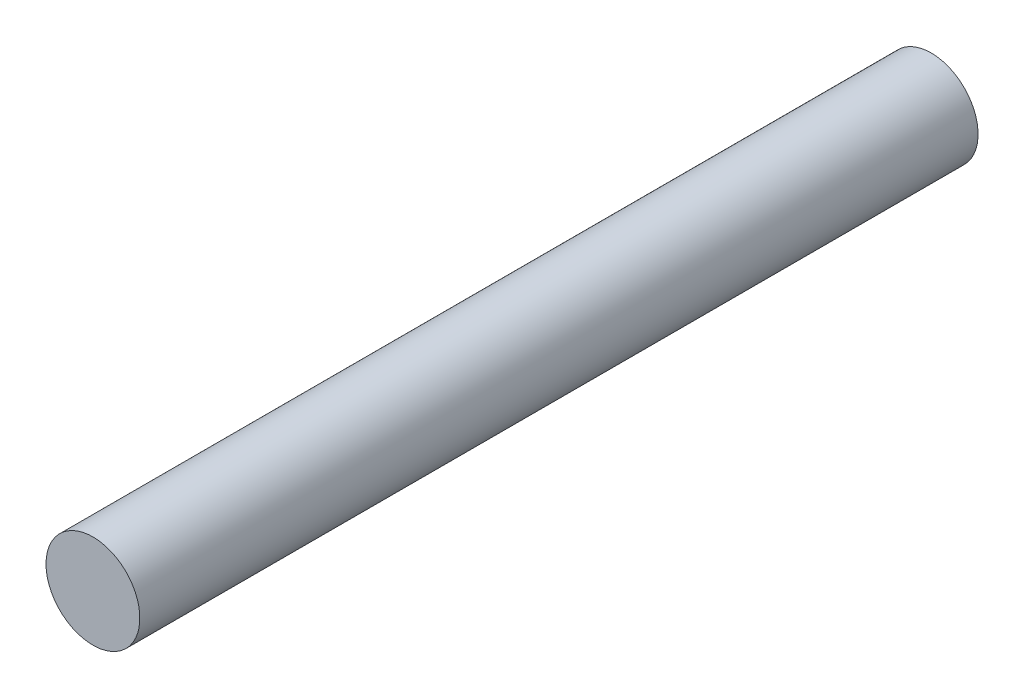
ISO-10303-21;
HEADER;
FILE_DESCRIPTION(('STEP AP214'),'2;1');
FILE_NAME('part.step','',(''),(''),'','','');
FILE_SCHEMA(('AUTOMOTIVE_DESIGN { 1 0 10303 214 1 1 1 1 }'));
ENDSEC;
DATA;
#1=APPLICATION_CONTEXT('core data for automotive mechanical design processes');
#2=APPLICATION_PROTOCOL_DEFINITION('international standard','automotive_design',2000,#1);
#3=PRODUCT_CONTEXT('',#1,'mechanical');
#4=PRODUCT('Part','Part','',(#3));
#5=PRODUCT_RELATED_PRODUCT_CATEGORY('part','',(#4));
#6=PRODUCT_DEFINITION_FORMATION('','',#4);
#7=PRODUCT_DEFINITION_CONTEXT('part definition',#1,'design');
#8=PRODUCT_DEFINITION('design','',#6,#7);
#9=PRODUCT_DEFINITION_SHAPE('','',#8);
#10=(LENGTH_UNIT() NAMED_UNIT(*) SI_UNIT(.MILLI.,.METRE.));
#11=(NAMED_UNIT(*) PLANE_ANGLE_UNIT() SI_UNIT($,.RADIAN.));
#12=(NAMED_UNIT(*) SI_UNIT($,.STERADIAN.) SOLID_ANGLE_UNIT());
#13=UNCERTAINTY_MEASURE_WITH_UNIT(LENGTH_MEASURE(1.E-05),#10,'distance_accuracy_value','');
#14=(GEOMETRIC_REPRESENTATION_CONTEXT(3) GLOBAL_UNCERTAINTY_ASSIGNED_CONTEXT((#13)) GLOBAL_UNIT_ASSIGNED_CONTEXT((#10,
#11,#12)) REPRESENTATION_CONTEXT('',''));
#15=CARTESIAN_POINT('',(0.,0.,0.));
#16=DIRECTION('',(0.,0.,1.));
#17=DIRECTION('',(1.,0.,0.));
#18=AXIS2_PLACEMENT_3D('',#15,#16,#17);
#19=CARTESIAN_POINT('',(0.15,0.,0.));
#20=DIRECTION('',(0.,0.,-1.));
#21=DIRECTION('',(-1.,0.,0.));
#22=AXIS2_PLACEMENT_3D('',#19,#20,#21);
#23=PLANE('',#22);
#24=CARTESIAN_POINT('',(0.,0.,0.));
#25=DIRECTION('',(0.,0.,-1.));
#26=DIRECTION('',(-1.,0.,0.));
#27=AXIS2_PLACEMENT_3D('',#24,#25,#26);
#28=CIRCLE('',#27,0.15);
#29=CARTESIAN_POINT('',(-0.15,0.,0.));
#30=VERTEX_POINT('',#29);
#31=EDGE_CURVE('E17',#30,#30,#28,.F.);
#32=ORIENTED_EDGE('',*,*,#31,.F.);
#33=EDGE_LOOP('',(#32));
#34=FACE_BOUND('',#33,.T.);
#35=ADVANCED_FACE('F14',(#34),#23,.T.);
#36=CARTESIAN_POINT('',(0.15,0.,2.68));
#37=DIRECTION('',(0.,0.,-1.));
#38=DIRECTION('',(-1.,0.,0.));
#39=AXIS2_PLACEMENT_3D('',#36,#37,#38);
#40=PLANE('',#39);
#41=CARTESIAN_POINT('',(0.,0.,2.68));
#42=DIRECTION('',(0.,0.,-1.));
#43=DIRECTION('',(-1.,0.,0.));
#44=AXIS2_PLACEMENT_3D('',#41,#42,#43);
#45=CIRCLE('',#44,0.15);
#46=CARTESIAN_POINT('',(-0.15,0.,2.68));
#47=VERTEX_POINT('',#46);
#48=EDGE_CURVE('E10',#47,#47,#45,.T.);
#49=ORIENTED_EDGE('',*,*,#48,.F.);
#50=EDGE_LOOP('',(#49));
#51=FACE_BOUND('',#50,.T.);
#52=ADVANCED_FACE('F29',(#51),#40,.F.);
#53=CARTESIAN_POINT('',(0.,0.,0.));
#54=DIRECTION('',(0.,0.,-1.));
#55=DIRECTION('',(-1.,0.,0.));
#56=AXIS2_PLACEMENT_3D('',#53,#54,#55);
#57=CYLINDRICAL_SURFACE('',#56,0.15);
#58=ORIENTED_EDGE('',*,*,#31,.T.);
#59=EDGE_LOOP('',(#58));
#60=FACE_BOUND('',#59,.T.);
#61=ORIENTED_EDGE('',*,*,#48,.T.);
#62=EDGE_LOOP('',(#61));
#63=FACE_BOUND('',#62,.T.);
#64=ADVANCED_FACE('F26',(#60,#63),#57,.T.);
#65=CLOSED_SHELL('',(#35,#52,#64));
#66=MANIFOLD_SOLID_BREP('B1',#65);
#67=ADVANCED_BREP_SHAPE_REPRESENTATION('',(#18,#66),#14);
#68=SHAPE_DEFINITION_REPRESENTATION(#9,#67);
ENDSEC;
END-ISO-10303-21;
